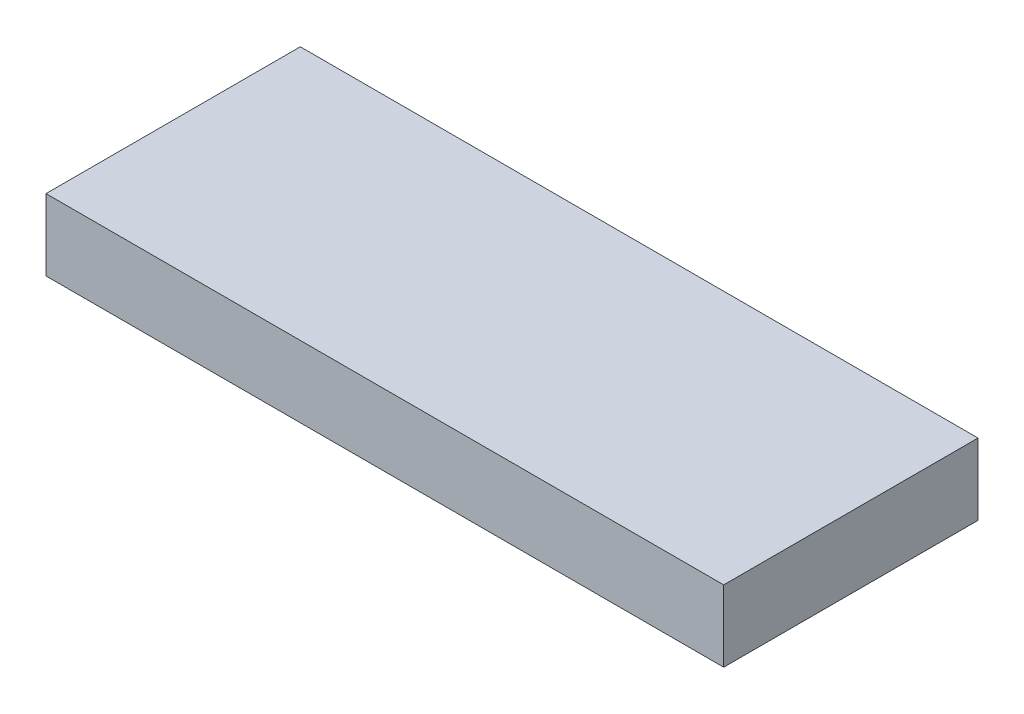
ISO-10303-21;
HEADER;
FILE_DESCRIPTION(('STEP AP214'),'2;1');
FILE_NAME('part.step','',(''),(''),'','','');
FILE_SCHEMA(('AUTOMOTIVE_DESIGN { 1 0 10303 214 1 1 1 1 }'));
ENDSEC;
DATA;
#1=APPLICATION_CONTEXT('core data for automotive mechanical design processes');
#2=APPLICATION_PROTOCOL_DEFINITION('international standard','automotive_design',2000,#1);
#3=PRODUCT_CONTEXT('',#1,'mechanical');
#4=PRODUCT('Part','Part','',(#3));
#5=PRODUCT_RELATED_PRODUCT_CATEGORY('part','',(#4));
#6=PRODUCT_DEFINITION_FORMATION('','',#4);
#7=PRODUCT_DEFINITION_CONTEXT('part definition',#1,'design');
#8=PRODUCT_DEFINITION('design','',#6,#7);
#9=PRODUCT_DEFINITION_SHAPE('','',#8);
#10=(LENGTH_UNIT() NAMED_UNIT(*) SI_UNIT(.MILLI.,.METRE.));
#11=(NAMED_UNIT(*) PLANE_ANGLE_UNIT() SI_UNIT($,.RADIAN.));
#12=(NAMED_UNIT(*) SI_UNIT($,.STERADIAN.) SOLID_ANGLE_UNIT());
#13=UNCERTAINTY_MEASURE_WITH_UNIT(LENGTH_MEASURE(1.E-05),#10,'distance_accuracy_value','');
#14=(GEOMETRIC_REPRESENTATION_CONTEXT(3) GLOBAL_UNCERTAINTY_ASSIGNED_CONTEXT((#13)) GLOBAL_UNIT_ASSIGNED_CONTEXT((#10,
#11,#12)) REPRESENTATION_CONTEXT('',''));
#15=CARTESIAN_POINT('',(0.,0.,0.));
#16=DIRECTION('',(0.,0.,1.));
#17=DIRECTION('',(1.,0.,0.));
#18=AXIS2_PLACEMENT_3D('',#15,#16,#17);
#19=CARTESIAN_POINT('',(0.,0.,0.));
#20=DIRECTION('',(0.,1.,0.));
#21=DIRECTION('',(0.,0.,1.));
#22=AXIS2_PLACEMENT_3D('',#19,#20,#21);
#23=PLANE('',#22);
#24=DIRECTION('',(0.,0.,1.));
#25=VECTOR('',#24,1.);
#26=CARTESIAN_POINT('',(-19.,0.,-5.));
#27=LINE('',#26,#25);
#28=CARTESIAN_POINT('',(-19.,0.,-5.));
#29=VERTEX_POINT('',#28);
#30=CARTESIAN_POINT('',(-19.,0.,9.26));
#31=VERTEX_POINT('',#30);
#32=EDGE_CURVE('E157',#29,#31,#27,.T.);
#33=ORIENTED_EDGE('',*,*,#32,.F.);
#34=DIRECTION('',(1.,0.,0.));
#35=VECTOR('',#34,1.);
#36=CARTESIAN_POINT('',(-19.,0.,-5.));
#37=LINE('',#36,#35);
#38=CARTESIAN_POINT('',(19.,0.,-5.));
#39=VERTEX_POINT('',#38);
#40=EDGE_CURVE('E150',#29,#39,#37,.T.);
#41=ORIENTED_EDGE('',*,*,#40,.T.);
#42=DIRECTION('',(0.,0.,1.));
#43=VECTOR('',#42,1.);
#44=CARTESIAN_POINT('',(19.,0.,-5.));
#45=LINE('',#44,#43);
#46=CARTESIAN_POINT('',(19.,0.,9.26));
#47=VERTEX_POINT('',#46);
#48=EDGE_CURVE('E162',#39,#47,#45,.T.);
#49=ORIENTED_EDGE('',*,*,#48,.T.);
#50=DIRECTION('',(1.,0.,0.));
#51=VECTOR('',#50,1.);
#52=CARTESIAN_POINT('',(-19.,0.,9.26));
#53=LINE('',#52,#51);
#54=EDGE_CURVE('E159',#31,#47,#53,.T.);
#55=ORIENTED_EDGE('',*,*,#54,.F.);
#56=EDGE_LOOP('',(#33,#41,#49,#55));
#57=FACE_BOUND('',#56,.T.);
#58=CARTESIAN_POINT('',(14.,0.,0.));
#59=DIRECTION('',(0.,1.,0.));
#60=DIRECTION('',(0.,0.,1.));
#61=AXIS2_PLACEMENT_3D('',#58,#59,#60);
#62=CIRCLE('',#61,3.);
#63=CARTESIAN_POINT('',(14.,0.,3.));
#64=VERTEX_POINT('',#63);
#65=EDGE_CURVE('E146',#64,#64,#62,.T.);
#66=ORIENTED_EDGE('',*,*,#65,.T.);
#67=EDGE_LOOP('',(#66));
#68=FACE_BOUND('',#67,.T.);
#69=CARTESIAN_POINT('',(-14.,0.,0.));
#70=DIRECTION('',(0.,1.,0.));
#71=DIRECTION('',(0.,0.,1.));
#72=AXIS2_PLACEMENT_3D('',#69,#70,#71);
#73=CIRCLE('',#72,3.);
#74=CARTESIAN_POINT('',(-14.,0.,3.));
#75=VERTEX_POINT('',#74);
#76=EDGE_CURVE('E43',#75,#75,#73,.T.);
#77=ORIENTED_EDGE('',*,*,#76,.T.);
#78=EDGE_LOOP('',(#77));
#79=FACE_BOUND('',#78,.T.);
#80=DIRECTION('',(1.,0.,0.));
#81=VECTOR('',#80,1.);
#82=CARTESIAN_POINT('',(0.,0.,7.26));
#83=LINE('',#82,#81);
#84=CARTESIAN_POINT('',(-1.6,0.,7.26));
#85=VERTEX_POINT('',#84);
#86=CARTESIAN_POINT('',(1.6,0.,7.26));
#87=VERTEX_POINT('',#86);
#88=EDGE_CURVE('E56',#85,#87,#83,.T.);
#89=ORIENTED_EDGE('',*,*,#88,.T.);
#90=DIRECTION('',(0.,0.,-1.));
#91=VECTOR('',#90,1.);
#92=CARTESIAN_POINT('',(1.6,0.,0.));
#93=LINE('',#92,#91);
#94=CARTESIAN_POINT('',(1.6,0.,4.06));
#95=VERTEX_POINT('',#94);
#96=EDGE_CURVE('E134',#87,#95,#93,.T.);
#97=ORIENTED_EDGE('',*,*,#96,.T.);
#98=DIRECTION('',(1.,0.,0.));
#99=VECTOR('',#98,1.);
#100=CARTESIAN_POINT('',(0.,0.,4.06));
#101=LINE('',#100,#99);
#102=CARTESIAN_POINT('',(-1.6,0.,4.06));
#103=VERTEX_POINT('',#102);
#104=EDGE_CURVE('E297',#103,#95,#101,.T.);
#105=ORIENTED_EDGE('',*,*,#104,.F.);
#106=DIRECTION('',(0.,0.,-1.));
#107=VECTOR('',#106,1.);
#108=CARTESIAN_POINT('',(-1.6,0.,0.));
#109=LINE('',#108,#107);
#110=EDGE_CURVE('E130',#85,#103,#109,.T.);
#111=ORIENTED_EDGE('',*,*,#110,.F.);
#112=EDGE_LOOP('',(#89,#97,#105,#111));
#113=FACE_BOUND('',#112,.T.);
#114=ADVANCED_FACE('F39',(#57,#68,#79,#113),#23,.F.);
#115=CARTESIAN_POINT('',(-19.,4.,-5.));
#116=DIRECTION('',(1.,0.,0.));
#117=DIRECTION('',(0.,0.,-1.));
#118=AXIS2_PLACEMENT_3D('',#115,#116,#117);
#119=PLANE('',#118);
#120=ORIENTED_EDGE('',*,*,#32,.T.);
#121=DIRECTION('',(0.,-1.,0.));
#122=VECTOR('',#121,1.);
#123=CARTESIAN_POINT('',(-19.,4.,9.26));
#124=LINE('',#123,#122);
#125=CARTESIAN_POINT('',(-19.,4.,9.26));
#126=VERTEX_POINT('',#125);
#127=EDGE_CURVE('E11',#126,#31,#124,.T.);
#128=ORIENTED_EDGE('',*,*,#127,.F.);
#129=DIRECTION('',(0.,0.,1.));
#130=VECTOR('',#129,1.);
#131=CARTESIAN_POINT('',(-19.,4.,-5.));
#132=LINE('',#131,#130);
#133=CARTESIAN_POINT('',(-19.,4.,-5.));
#134=VERTEX_POINT('',#133);
#135=EDGE_CURVE('E148',#134,#126,#132,.T.);
#136=ORIENTED_EDGE('',*,*,#135,.F.);
#137=DIRECTION('',(0.,-1.,0.));
#138=VECTOR('',#137,1.);
#139=CARTESIAN_POINT('',(-19.,4.,-5.));
#140=LINE('',#139,#138);
#141=EDGE_CURVE('E65',#134,#29,#140,.T.);
#142=ORIENTED_EDGE('',*,*,#141,.T.);
#143=EDGE_LOOP('',(#120,#128,#136,#142));
#144=FACE_BOUND('',#143,.T.);
#145=ADVANCED_FACE('F41',(#144),#119,.F.);
#146=CARTESIAN_POINT('',(-19.,4.,9.26));
#147=DIRECTION('',(0.,0.,-1.));
#148=DIRECTION('',(-1.,0.,0.));
#149=AXIS2_PLACEMENT_3D('',#146,#147,#148);
#150=PLANE('',#149);
#151=ORIENTED_EDGE('',*,*,#54,.T.);
#152=DIRECTION('',(0.,-1.,0.));
#153=VECTOR('',#152,1.);
#154=CARTESIAN_POINT('',(19.,4.,9.26));
#155=LINE('',#154,#153);
#156=CARTESIAN_POINT('',(19.,4.,9.26));
#157=VERTEX_POINT('',#156);
#158=EDGE_CURVE('E48',#157,#47,#155,.T.);
#159=ORIENTED_EDGE('',*,*,#158,.F.);
#160=DIRECTION('',(1.,0.,0.));
#161=VECTOR('',#160,1.);
#162=CARTESIAN_POINT('',(-19.,4.,9.26));
#163=LINE('',#162,#161);
#164=EDGE_CURVE('E91',#126,#157,#163,.T.);
#165=ORIENTED_EDGE('',*,*,#164,.F.);
#166=ORIENTED_EDGE('',*,*,#127,.T.);
#167=EDGE_LOOP('',(#151,#159,#165,#166));
#168=FACE_BOUND('',#167,.T.);
#169=ADVANCED_FACE('F200',(#168),#150,.F.);
#170=CARTESIAN_POINT('',(19.,4.,-5.));
#171=DIRECTION('',(1.,0.,0.));
#172=DIRECTION('',(0.,0.,-1.));
#173=AXIS2_PLACEMENT_3D('',#170,#171,#172);
#174=PLANE('',#173);
#175=ORIENTED_EDGE('',*,*,#48,.F.);
#176=DIRECTION('',(0.,-1.,0.));
#177=VECTOR('',#176,1.);
#178=CARTESIAN_POINT('',(19.,4.,-5.));
#179=LINE('',#178,#177);
#180=CARTESIAN_POINT('',(19.,4.,-5.));
#181=VERTEX_POINT('',#180);
#182=EDGE_CURVE('E168',#181,#39,#179,.T.);
#183=ORIENTED_EDGE('',*,*,#182,.F.);
#184=DIRECTION('',(0.,0.,1.));
#185=VECTOR('',#184,1.);
#186=CARTESIAN_POINT('',(19.,4.,-5.));
#187=LINE('',#186,#185);
#188=EDGE_CURVE('E152',#181,#157,#187,.T.);
#189=ORIENTED_EDGE('',*,*,#188,.T.);
#190=ORIENTED_EDGE('',*,*,#158,.T.);
#191=EDGE_LOOP('',(#175,#183,#189,#190));
#192=FACE_BOUND('',#191,.T.);
#193=ADVANCED_FACE('F208',(#192),#174,.T.);
#194=CARTESIAN_POINT('',(-19.,4.,-5.));
#195=DIRECTION('',(0.,0.,-1.));
#196=DIRECTION('',(-1.,0.,0.));
#197=AXIS2_PLACEMENT_3D('',#194,#195,#196);
#198=PLANE('',#197);
#199=ORIENTED_EDGE('',*,*,#40,.F.);
#200=ORIENTED_EDGE('',*,*,#141,.F.);
#201=DIRECTION('',(1.,0.,0.));
#202=VECTOR('',#201,1.);
#203=CARTESIAN_POINT('',(-19.,4.,-5.));
#204=LINE('',#203,#202);
#205=EDGE_CURVE('E155',#134,#181,#204,.T.);
#206=ORIENTED_EDGE('',*,*,#205,.T.);
#207=ORIENTED_EDGE('',*,*,#182,.T.);
#208=EDGE_LOOP('',(#199,#200,#206,#207));
#209=FACE_BOUND('',#208,.T.);
#210=ADVANCED_FACE('F205',(#209),#198,.T.);
#211=CARTESIAN_POINT('',(0.,4.,0.));
#212=DIRECTION('',(0.,1.,0.));
#213=DIRECTION('',(0.,0.,1.));
#214=AXIS2_PLACEMENT_3D('',#211,#212,#213);
#215=PLANE('',#214);
#216=ORIENTED_EDGE('',*,*,#135,.T.);
#217=ORIENTED_EDGE('',*,*,#164,.T.);
#218=ORIENTED_EDGE('',*,*,#188,.F.);
#219=ORIENTED_EDGE('',*,*,#205,.F.);
#220=EDGE_LOOP('',(#216,#217,#218,#219));
#221=FACE_BOUND('',#220,.T.);
#222=ADVANCED_FACE('F203',(#221),#215,.T.);
#223=CARTESIAN_POINT('',(14.,-1.2E-05,0.));
#224=DIRECTION('',(0.,1.,0.));
#225=DIRECTION('',(0.,0.,1.));
#226=AXIS2_PLACEMENT_3D('',#223,#224,#225);
#227=CYLINDRICAL_SURFACE('',#226,3.);
#228=CARTESIAN_POINT('',(14.,1.8,0.));
#229=DIRECTION('',(0.,1.,0.));
#230=DIRECTION('',(0.,0.,1.));
#231=AXIS2_PLACEMENT_3D('',#228,#229,#230);
#232=CIRCLE('',#231,3.);
#233=CARTESIAN_POINT('',(14.,1.8,3.));
#234=VERTEX_POINT('',#233);
#235=EDGE_CURVE('E135',#234,#234,#232,.T.);
#236=CARTESIAN_POINT('',(14.,1.8,3.));
#237=CARTESIAN_POINT('',(14.,1.78125,3.));
#238=CARTESIAN_POINT('',(14.,1.7625,3.));
#239=CARTESIAN_POINT('',(14.,1.725,3.));
#240=CARTESIAN_POINT('',(14.,1.70625,3.));
#241=CARTESIAN_POINT('',(14.,1.66875,3.));
#242=CARTESIAN_POINT('',(14.,1.65,3.));
#243=CARTESIAN_POINT('',(14.,1.6125,3.));
#244=CARTESIAN_POINT('',(14.,1.59375,3.));
#245=CARTESIAN_POINT('',(14.,1.55625,3.));
#246=CARTESIAN_POINT('',(14.,1.5375,3.));
#247=CARTESIAN_POINT('',(14.,1.5,3.));
#248=CARTESIAN_POINT('',(14.,1.48125,3.));
#249=CARTESIAN_POINT('',(14.,1.44375,3.));
#250=CARTESIAN_POINT('',(14.,1.425,3.));
#251=CARTESIAN_POINT('',(14.,1.3875,3.));
#252=CARTESIAN_POINT('',(14.,1.36875,3.));
#253=CARTESIAN_POINT('',(14.,1.33125,3.));
#254=CARTESIAN_POINT('',(14.,1.3125,3.));
#255=CARTESIAN_POINT('',(14.,1.275,3.));
#256=CARTESIAN_POINT('',(14.,1.25625,3.));
#257=CARTESIAN_POINT('',(14.,1.21875,3.));
#258=CARTESIAN_POINT('',(14.,1.2,3.));
#259=CARTESIAN_POINT('',(14.,1.1625,3.));
#260=CARTESIAN_POINT('',(14.,1.14375,3.));
#261=CARTESIAN_POINT('',(14.,1.10625,3.));
#262=CARTESIAN_POINT('',(14.,1.0875,3.));
#263=CARTESIAN_POINT('',(14.,1.05,3.));
#264=CARTESIAN_POINT('',(14.,1.03125,3.));
#265=CARTESIAN_POINT('',(14.,0.99375,3.));
#266=CARTESIAN_POINT('',(14.,0.975,3.));
#267=CARTESIAN_POINT('',(14.,0.9375,3.));
#268=CARTESIAN_POINT('',(14.,0.91875,3.));
#269=CARTESIAN_POINT('',(14.,0.88125,3.));
#270=CARTESIAN_POINT('',(14.,0.8625,3.));
#271=CARTESIAN_POINT('',(14.,0.825,3.));
#272=CARTESIAN_POINT('',(14.,0.80625,3.));
#273=CARTESIAN_POINT('',(14.,0.76875,3.));
#274=CARTESIAN_POINT('',(14.,0.75,3.));
#275=CARTESIAN_POINT('',(14.,0.7125,3.));
#276=CARTESIAN_POINT('',(14.,0.69375,3.));
#277=CARTESIAN_POINT('',(14.,0.65625,3.));
#278=CARTESIAN_POINT('',(14.,0.6375,3.));
#279=CARTESIAN_POINT('',(14.,0.6,3.));
#280=CARTESIAN_POINT('',(14.,0.58125,3.));
#281=CARTESIAN_POINT('',(14.,0.54375,3.));
#282=CARTESIAN_POINT('',(14.,0.525,3.));
#283=CARTESIAN_POINT('',(14.,0.4875,3.));
#284=CARTESIAN_POINT('',(14.,0.46875,3.));
#285=CARTESIAN_POINT('',(14.,0.43125,3.));
#286=CARTESIAN_POINT('',(14.,0.4125,3.));
#287=CARTESIAN_POINT('',(14.,0.375,3.));
#288=CARTESIAN_POINT('',(14.,0.35625,3.));
#289=CARTESIAN_POINT('',(14.,0.31875,3.));
#290=CARTESIAN_POINT('',(14.,0.3,3.));
#291=CARTESIAN_POINT('',(14.,0.2625,3.));
#292=CARTESIAN_POINT('',(14.,0.24375,3.));
#293=CARTESIAN_POINT('',(14.,0.20625,3.));
#294=CARTESIAN_POINT('',(14.,0.1875,3.));
#295=CARTESIAN_POINT('',(14.,0.15,3.));
#296=CARTESIAN_POINT('',(14.,0.13125,3.));
#297=CARTESIAN_POINT('',(14.,0.09375,3.));
#298=CARTESIAN_POINT('',(14.,0.075,3.));
#299=CARTESIAN_POINT('',(14.,0.0375,3.));
#300=CARTESIAN_POINT('',(14.,0.01875,3.));
#301=CARTESIAN_POINT('',(14.,0.,3.));
#302=B_SPLINE_CURVE_WITH_KNOTS('',3,(#236,#237,#238,#239,#240,#241,#242,#243,#244,#245,#246,
#247,#248,#249,#250,#251,#252,#253,#254,#255,#256,#257,#258,#259,#260,#261,#262,#263,#264,#265,
#266,#267,#268,#269,#270,#271,#272,#273,#274,#275,#276,#277,#278,#279,#280,#281,#282,#283,#284,
#285,#286,#287,#288,#289,#290,#291,#292,#293,#294,#295,#296,#297,#298,#299,#300,#301),
.UNSPECIFIED.,.F.,.F.,(4,2,2,2,2,2,2,2,2,2,2,2,2,2,2,2,2,2,2,2,2,2,2,2,2,2,2,2,2,2,2,2,4),(0.,
0.0562500000000001,0.1125,0.16875,0.225,0.28125,0.3375,0.39375,0.45,0.50625,0.5625,0.61875,
0.675,0.73125,0.7875,0.84375,0.9,0.95625,1.0125,1.06875,1.125,1.18125,1.2375,1.29375,1.35,
1.40625,1.4625,1.51875,1.575,1.63125,1.6875,1.74375,1.8),.UNSPECIFIED.);
#303=EDGE_CURVE('BSEAM190',#234,#64,#302,.T.);
#304=ORIENTED_EDGE('',*,*,#235,.T.);
#305=ORIENTED_EDGE('',*,*,#65,.F.);
#306=ORIENTED_EDGE('',*,*,#303,.T.);
#307=ORIENTED_EDGE('',*,*,#303,.F.);
#308=EDGE_LOOP('',(#304,#306,#305,#307));
#309=FACE_BOUND('',#308,.T.);
#310=ADVANCED_FACE('F190',(#309),#227,.F.);
#311=CARTESIAN_POINT('',(0.,1.8,0.));
#312=DIRECTION('',(0.,1.,0.));
#313=DIRECTION('',(0.,0.,1.));
#314=AXIS2_PLACEMENT_3D('',#311,#312,#313);
#315=PLANE('',#314);
#316=ORIENTED_EDGE('',*,*,#235,.F.);
#317=EDGE_LOOP('',(#316));
#318=FACE_BOUND('',#317,.T.);
#319=ADVANCED_FACE('F181',(#318),#315,.F.);
#320=CARTESIAN_POINT('',(-14.,-1.2E-05,0.));
#321=DIRECTION('',(0.,1.,0.));
#322=DIRECTION('',(0.,0.,1.));
#323=AXIS2_PLACEMENT_3D('',#320,#321,#322);
#324=CYLINDRICAL_SURFACE('',#323,3.);
#325=CARTESIAN_POINT('',(-14.,1.8,0.));
#326=DIRECTION('',(0.,1.,0.));
#327=DIRECTION('',(0.,0.,1.));
#328=AXIS2_PLACEMENT_3D('',#325,#326,#327);
#329=CIRCLE('',#328,3.);
#330=CARTESIAN_POINT('',(-14.,1.8,3.));
#331=VERTEX_POINT('',#330);
#332=EDGE_CURVE('E139',#331,#331,#329,.T.);
#333=CARTESIAN_POINT('',(-14.,1.8,3.));
#334=CARTESIAN_POINT('',(-14.,1.78125,3.));
#335=CARTESIAN_POINT('',(-14.,1.7625,3.));
#336=CARTESIAN_POINT('',(-14.,1.725,3.));
#337=CARTESIAN_POINT('',(-14.,1.70625,3.));
#338=CARTESIAN_POINT('',(-14.,1.66875,3.));
#339=CARTESIAN_POINT('',(-14.,1.65,3.));
#340=CARTESIAN_POINT('',(-14.,1.6125,3.));
#341=CARTESIAN_POINT('',(-14.,1.59375,3.));
#342=CARTESIAN_POINT('',(-14.,1.55625,3.));
#343=CARTESIAN_POINT('',(-14.,1.5375,3.));
#344=CARTESIAN_POINT('',(-14.,1.5,3.));
#345=CARTESIAN_POINT('',(-14.,1.48125,3.));
#346=CARTESIAN_POINT('',(-14.,1.44375,3.));
#347=CARTESIAN_POINT('',(-14.,1.425,3.));
#348=CARTESIAN_POINT('',(-14.,1.3875,3.));
#349=CARTESIAN_POINT('',(-14.,1.36875,3.));
#350=CARTESIAN_POINT('',(-14.,1.33125,3.));
#351=CARTESIAN_POINT('',(-14.,1.3125,3.));
#352=CARTESIAN_POINT('',(-14.,1.275,3.));
#353=CARTESIAN_POINT('',(-14.,1.25625,3.));
#354=CARTESIAN_POINT('',(-14.,1.21875,3.));
#355=CARTESIAN_POINT('',(-14.,1.2,3.));
#356=CARTESIAN_POINT('',(-14.,1.1625,3.));
#357=CARTESIAN_POINT('',(-14.,1.14375,3.));
#358=CARTESIAN_POINT('',(-14.,1.10625,3.));
#359=CARTESIAN_POINT('',(-14.,1.0875,3.));
#360=CARTESIAN_POINT('',(-14.,1.05,3.));
#361=CARTESIAN_POINT('',(-14.,1.03125,3.));
#362=CARTESIAN_POINT('',(-14.,0.99375,3.));
#363=CARTESIAN_POINT('',(-14.,0.975,3.));
#364=CARTESIAN_POINT('',(-14.,0.9375,3.));
#365=CARTESIAN_POINT('',(-14.,0.91875,3.));
#366=CARTESIAN_POINT('',(-14.,0.88125,3.));
#367=CARTESIAN_POINT('',(-14.,0.8625,3.));
#368=CARTESIAN_POINT('',(-14.,0.825,3.));
#369=CARTESIAN_POINT('',(-14.,0.80625,3.));
#370=CARTESIAN_POINT('',(-14.,0.76875,3.));
#371=CARTESIAN_POINT('',(-14.,0.75,3.));
#372=CARTESIAN_POINT('',(-14.,0.7125,3.));
#373=CARTESIAN_POINT('',(-14.,0.69375,3.));
#374=CARTESIAN_POINT('',(-14.,0.65625,3.));
#375=CARTESIAN_POINT('',(-14.,0.6375,3.));
#376=CARTESIAN_POINT('',(-14.,0.6,3.));
#377=CARTESIAN_POINT('',(-14.,0.58125,3.));
#378=CARTESIAN_POINT('',(-14.,0.54375,3.));
#379=CARTESIAN_POINT('',(-14.,0.525,3.));
#380=CARTESIAN_POINT('',(-14.,0.4875,3.));
#381=CARTESIAN_POINT('',(-14.,0.46875,3.));
#382=CARTESIAN_POINT('',(-14.,0.43125,3.));
#383=CARTESIAN_POINT('',(-14.,0.4125,3.));
#384=CARTESIAN_POINT('',(-14.,0.375,3.));
#385=CARTESIAN_POINT('',(-14.,0.35625,3.));
#386=CARTESIAN_POINT('',(-14.,0.31875,3.));
#387=CARTESIAN_POINT('',(-14.,0.3,3.));
#388=CARTESIAN_POINT('',(-14.,0.2625,3.));
#389=CARTESIAN_POINT('',(-14.,0.24375,3.));
#390=CARTESIAN_POINT('',(-14.,0.20625,3.));
#391=CARTESIAN_POINT('',(-14.,0.1875,3.));
#392=CARTESIAN_POINT('',(-14.,0.15,3.));
#393=CARTESIAN_POINT('',(-14.,0.13125,3.));
#394=CARTESIAN_POINT('',(-14.,0.09375,3.));
#395=CARTESIAN_POINT('',(-14.,0.075,3.));
#396=CARTESIAN_POINT('',(-14.,0.0375,3.));
#397=CARTESIAN_POINT('',(-14.,0.01875,3.));
#398=CARTESIAN_POINT('',(-14.,0.,3.));
#399=B_SPLINE_CURVE_WITH_KNOTS('',3,(#333,#334,#335,#336,#337,#338,#339,#340,#341,#342,#343,
#344,#345,#346,#347,#348,#349,#350,#351,#352,#353,#354,#355,#356,#357,#358,#359,#360,#361,#362,
#363,#364,#365,#366,#367,#368,#369,#370,#371,#372,#373,#374,#375,#376,#377,#378,#379,#380,#381,
#382,#383,#384,#385,#386,#387,#388,#389,#390,#391,#392,#393,#394,#395,#396,#397,#398),
.UNSPECIFIED.,.F.,.F.,(4,2,2,2,2,2,2,2,2,2,2,2,2,2,2,2,2,2,2,2,2,2,2,2,2,2,2,2,2,2,2,2,4),(0.,
0.0562500000000001,0.1125,0.16875,0.225,0.28125,0.3375,0.39375,0.45,0.50625,0.5625,0.61875,
0.675,0.73125,0.7875,0.84375,0.9,0.95625,1.0125,1.06875,1.125,1.18125,1.2375,1.29375,1.35,
1.40625,1.4625,1.51875,1.575,1.63125,1.6875,1.74375,1.8),.UNSPECIFIED.);
#400=EDGE_CURVE('BSEAM178',#331,#75,#399,.T.);
#401=ORIENTED_EDGE('',*,*,#332,.T.);
#402=ORIENTED_EDGE('',*,*,#76,.F.);
#403=ORIENTED_EDGE('',*,*,#400,.T.);
#404=ORIENTED_EDGE('',*,*,#400,.F.);
#405=EDGE_LOOP('',(#401,#403,#402,#404));
#406=FACE_BOUND('',#405,.T.);
#407=ADVANCED_FACE('F178',(#406),#324,.F.);
#408=CARTESIAN_POINT('',(0.,1.8,0.));
#409=DIRECTION('',(0.,1.,0.));
#410=DIRECTION('',(0.,0.,1.));
#411=AXIS2_PLACEMENT_3D('',#408,#409,#410);
#412=PLANE('',#411);
#413=ORIENTED_EDGE('',*,*,#332,.F.);
#414=EDGE_LOOP('',(#413));
#415=FACE_BOUND('',#414,.T.);
#416=ADVANCED_FACE('F180',(#415),#412,.F.);
#417=CARTESIAN_POINT('',(0.,2.8,7.26));
#418=DIRECTION('',(0.,0.,-1.));
#419=DIRECTION('',(-1.,0.,0.));
#420=AXIS2_PLACEMENT_3D('',#417,#418,#419);
#421=PLANE('',#420);
#422=ORIENTED_EDGE('',*,*,#88,.F.);
#423=DIRECTION('',(0.,-1.,0.));
#424=VECTOR('',#423,1.);
#425=CARTESIAN_POINT('',(-1.6,2.8,7.26));
#426=LINE('',#425,#424);
#427=CARTESIAN_POINT('',(-1.6,2.8,7.26));
#428=VERTEX_POINT('',#427);
#429=EDGE_CURVE('E129',#428,#85,#426,.T.);
#430=ORIENTED_EDGE('',*,*,#429,.F.);
#431=DIRECTION('',(1.,0.,0.));
#432=VECTOR('',#431,1.);
#433=CARTESIAN_POINT('',(0.,2.8,7.26));
#434=LINE('',#433,#432);
#435=CARTESIAN_POINT('',(1.6,2.8,7.26));
#436=VERTEX_POINT('',#435);
#437=EDGE_CURVE('E119',#428,#436,#434,.T.);
#438=ORIENTED_EDGE('',*,*,#437,.T.);
#439=DIRECTION('',(0.,-1.,0.));
#440=VECTOR('',#439,1.);
#441=CARTESIAN_POINT('',(1.6,2.8,7.26));
#442=LINE('',#441,#440);
#443=EDGE_CURVE('E128',#436,#87,#442,.T.);
#444=ORIENTED_EDGE('',*,*,#443,.T.);
#445=EDGE_LOOP('',(#422,#430,#438,#444));
#446=FACE_BOUND('',#445,.T.);
#447=ADVANCED_FACE('F127',(#446),#421,.T.);
#448=CARTESIAN_POINT('',(1.6,2.8,0.));
#449=DIRECTION('',(-1.,0.,0.));
#450=DIRECTION('',(0.,0.,1.));
#451=AXIS2_PLACEMENT_3D('',#448,#449,#450);
#452=PLANE('',#451);
#453=ORIENTED_EDGE('',*,*,#96,.F.);
#454=ORIENTED_EDGE('',*,*,#443,.F.);
#455=DIRECTION('',(0.,0.,-1.));
#456=VECTOR('',#455,1.);
#457=CARTESIAN_POINT('',(1.6,2.8,0.));
#458=LINE('',#457,#456);
#459=CARTESIAN_POINT('',(1.6,2.8,4.06));
#460=VERTEX_POINT('',#459);
#461=EDGE_CURVE('E115',#436,#460,#458,.T.);
#462=ORIENTED_EDGE('',*,*,#461,.T.);
#463=DIRECTION('',(0.,-1.,0.));
#464=VECTOR('',#463,1.);
#465=CARTESIAN_POINT('',(1.6,2.8,4.06));
#466=LINE('',#465,#464);
#467=EDGE_CURVE('E136',#460,#95,#466,.T.);
#468=ORIENTED_EDGE('',*,*,#467,.T.);
#469=EDGE_LOOP('',(#453,#454,#462,#468));
#470=FACE_BOUND('',#469,.T.);
#471=ADVANCED_FACE('F132',(#470),#452,.T.);
#472=CARTESIAN_POINT('',(0.,2.8,4.06));
#473=DIRECTION('',(0.,0.,-1.));
#474=DIRECTION('',(-1.,0.,0.));
#475=AXIS2_PLACEMENT_3D('',#472,#473,#474);
#476=PLANE('',#475);
#477=ORIENTED_EDGE('',*,*,#104,.T.);
#478=ORIENTED_EDGE('',*,*,#467,.F.);
#479=DIRECTION('',(1.,0.,0.));
#480=VECTOR('',#479,1.);
#481=CARTESIAN_POINT('',(0.,2.8,4.06));
#482=LINE('',#481,#480);
#483=CARTESIAN_POINT('',(-1.6,2.8,4.06));
#484=VERTEX_POINT('',#483);
#485=EDGE_CURVE('E122',#484,#460,#482,.T.);
#486=ORIENTED_EDGE('',*,*,#485,.F.);
#487=DIRECTION('',(0.,-1.,0.));
#488=VECTOR('',#487,1.);
#489=CARTESIAN_POINT('',(-1.6,2.8,4.06));
#490=LINE('',#489,#488);
#491=EDGE_CURVE('E141',#484,#103,#490,.T.);
#492=ORIENTED_EDGE('',*,*,#491,.T.);
#493=EDGE_LOOP('',(#477,#478,#486,#492));
#494=FACE_BOUND('',#493,.T.);
#495=ADVANCED_FACE('F264',(#494),#476,.F.);
#496=CARTESIAN_POINT('',(-1.6,2.8,0.));
#497=DIRECTION('',(-1.,0.,0.));
#498=DIRECTION('',(0.,0.,1.));
#499=AXIS2_PLACEMENT_3D('',#496,#497,#498);
#500=PLANE('',#499);
#501=ORIENTED_EDGE('',*,*,#110,.T.);
#502=ORIENTED_EDGE('',*,*,#491,.F.);
#503=DIRECTION('',(0.,0.,-1.));
#504=VECTOR('',#503,1.);
#505=CARTESIAN_POINT('',(-1.6,2.8,0.));
#506=LINE('',#505,#504);
#507=EDGE_CURVE('E304',#428,#484,#506,.T.);
#508=ORIENTED_EDGE('',*,*,#507,.F.);
#509=ORIENTED_EDGE('',*,*,#429,.T.);
#510=EDGE_LOOP('',(#501,#502,#508,#509));
#511=FACE_BOUND('',#510,.T.);
#512=ADVANCED_FACE('F273',(#511),#500,.F.);
#513=CARTESIAN_POINT('',(0.,2.8,0.));
#514=DIRECTION('',(0.,1.,0.));
#515=DIRECTION('',(0.,0.,1.));
#516=AXIS2_PLACEMENT_3D('',#513,#514,#515);
#517=PLANE('',#516);
#518=ORIENTED_EDGE('',*,*,#437,.F.);
#519=ORIENTED_EDGE('',*,*,#507,.T.);
#520=ORIENTED_EDGE('',*,*,#485,.T.);
#521=ORIENTED_EDGE('',*,*,#461,.F.);
#522=EDGE_LOOP('',(#518,#519,#520,#521));
#523=FACE_BOUND('',#522,.T.);
#524=ADVANCED_FACE('F117',(#523),#517,.F.);
#525=CLOSED_SHELL('',(#114,#145,#169,#193,#210,#222,#310,#319,#407,#416,#447,#471,#495,#512,#524));
#526=MANIFOLD_SOLID_BREP('B2',#525);
#527=ADVANCED_BREP_SHAPE_REPRESENTATION('',(#18,#526),#14);
#528=SHAPE_DEFINITION_REPRESENTATION(#9,#527);
ENDSEC;
END-ISO-10303-21;
